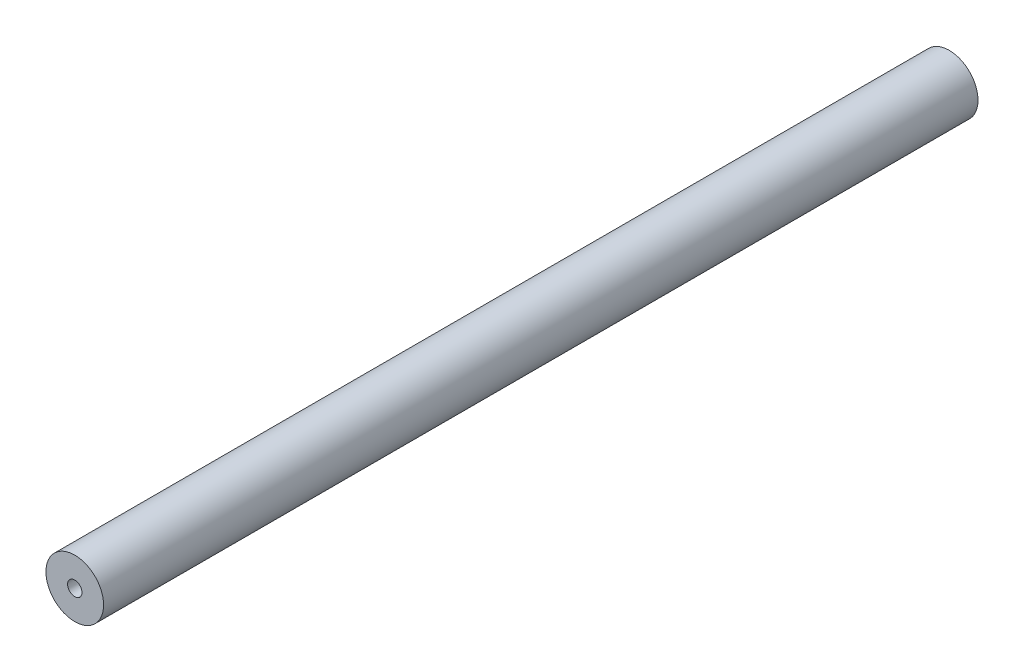
ISO-10303-21;
HEADER;
FILE_DESCRIPTION(('STEP AP214'),'2;1');
FILE_NAME('part.step','',(''),(''),'','','');
FILE_SCHEMA(('AUTOMOTIVE_DESIGN { 1 0 10303 214 1 1 1 1 }'));
ENDSEC;
DATA;
#1=APPLICATION_CONTEXT('core data for automotive mechanical design processes');
#2=APPLICATION_PROTOCOL_DEFINITION('international standard','automotive_design',2000,#1);
#3=PRODUCT_CONTEXT('',#1,'mechanical');
#4=PRODUCT('Part','Part','',(#3));
#5=PRODUCT_RELATED_PRODUCT_CATEGORY('part','',(#4));
#6=PRODUCT_DEFINITION_FORMATION('','',#4);
#7=PRODUCT_DEFINITION_CONTEXT('part definition',#1,'design');
#8=PRODUCT_DEFINITION('design','',#6,#7);
#9=PRODUCT_DEFINITION_SHAPE('','',#8);
#10=(LENGTH_UNIT() NAMED_UNIT(*) SI_UNIT(.MILLI.,.METRE.));
#11=(NAMED_UNIT(*) PLANE_ANGLE_UNIT() SI_UNIT($,.RADIAN.));
#12=(NAMED_UNIT(*) SI_UNIT($,.STERADIAN.) SOLID_ANGLE_UNIT());
#13=UNCERTAINTY_MEASURE_WITH_UNIT(LENGTH_MEASURE(1.E-05),#10,'distance_accuracy_value','');
#14=(GEOMETRIC_REPRESENTATION_CONTEXT(3) GLOBAL_UNCERTAINTY_ASSIGNED_CONTEXT((#13)) GLOBAL_UNIT_ASSIGNED_CONTEXT((#10,
#11,#12)) REPRESENTATION_CONTEXT('',''));
#15=CARTESIAN_POINT('',(0.,0.,0.));
#16=DIRECTION('',(0.,0.,1.));
#17=DIRECTION('',(1.,0.,0.));
#18=AXIS2_PLACEMENT_3D('',#15,#16,#17);
#19=CARTESIAN_POINT('',(0.,0.,182.));
#20=DIRECTION('',(0.,0.,-1.));
#21=DIRECTION('',(-1.,0.,0.));
#22=AXIS2_PLACEMENT_3D('',#19,#20,#21);
#23=CYLINDRICAL_SURFACE('',#22,6.);
#24=CARTESIAN_POINT('',(0.,0.,182.));
#25=DIRECTION('',(0.,0.,1.));
#26=DIRECTION('',(1.,0.,0.));
#27=AXIS2_PLACEMENT_3D('',#24,#25,#26);
#28=CIRCLE('',#27,6.);
#29=CARTESIAN_POINT('',(6.,0.,182.));
#30=VERTEX_POINT('',#29);
#31=EDGE_CURVE('E10',#30,#30,#28,.T.);
#32=ORIENTED_EDGE('',*,*,#31,.F.);
#33=EDGE_LOOP('',(#32));
#34=FACE_BOUND('',#33,.T.);
#35=CARTESIAN_POINT('',(0.,0.,0.));
#36=DIRECTION('',(0.,0.,1.));
#37=DIRECTION('',(1.,0.,0.));
#38=AXIS2_PLACEMENT_3D('',#35,#36,#37);
#39=CIRCLE('',#38,6.);
#40=CARTESIAN_POINT('',(6.,0.,0.));
#41=VERTEX_POINT('',#40);
#42=EDGE_CURVE('E36',#41,#41,#39,.T.);
#43=ORIENTED_EDGE('',*,*,#42,.T.);
#44=EDGE_LOOP('',(#43));
#45=FACE_BOUND('',#44,.T.);
#46=ADVANCED_FACE('F33',(#34,#45),#23,.T.);
#47=CARTESIAN_POINT('',(0.,0.,182.));
#48=DIRECTION('',(0.,0.,1.));
#49=DIRECTION('',(1.,0.,0.));
#50=AXIS2_PLACEMENT_3D('',#47,#48,#49);
#51=PLANE('',#50);
#52=CARTESIAN_POINT('',(0.,0.,182.));
#53=DIRECTION('',(0.,0.,1.));
#54=DIRECTION('',(1.,0.,0.));
#55=AXIS2_PLACEMENT_3D('',#52,#53,#54);
#56=CIRCLE('',#55,1.5);
#57=CARTESIAN_POINT('',(1.5,0.,182.));
#58=VERTEX_POINT('',#57);
#59=EDGE_CURVE('E45',#58,#58,#56,.T.);
#60=ORIENTED_EDGE('',*,*,#59,.F.);
#61=EDGE_LOOP('',(#60));
#62=FACE_BOUND('',#61,.T.);
#63=ORIENTED_EDGE('',*,*,#31,.T.);
#64=EDGE_LOOP('',(#63));
#65=FACE_BOUND('',#64,.T.);
#66=ADVANCED_FACE('F70',(#62,#65),#51,.T.);
#67=CARTESIAN_POINT('',(0.,0.,0.));
#68=DIRECTION('',(0.,0.,1.));
#69=DIRECTION('',(1.,0.,0.));
#70=AXIS2_PLACEMENT_3D('',#67,#68,#69);
#71=PLANE('',#70);
#72=CARTESIAN_POINT('',(0.,0.,0.));
#73=DIRECTION('',(0.,0.,-1.));
#74=DIRECTION('',(-1.,0.,0.));
#75=AXIS2_PLACEMENT_3D('',#72,#73,#74);
#76=CIRCLE('',#75,1.5);
#77=CARTESIAN_POINT('',(-1.5,0.,0.));
#78=VERTEX_POINT('',#77);
#79=EDGE_CURVE('E51',#78,#78,#76,.T.);
#80=ORIENTED_EDGE('',*,*,#79,.F.);
#81=EDGE_LOOP('',(#80));
#82=FACE_BOUND('',#81,.T.);
#83=ORIENTED_EDGE('',*,*,#42,.F.);
#84=EDGE_LOOP('',(#83));
#85=FACE_BOUND('',#84,.T.);
#86=ADVANCED_FACE('F66',(#82,#85),#71,.F.);
#87=CARTESIAN_POINT('',(0.,0.,173.2));
#88=DIRECTION('',(0.,0.,1.));
#89=DIRECTION('',(1.,0.,0.));
#90=AXIS2_PLACEMENT_3D('',#87,#88,#89);
#91=CYLINDRICAL_SURFACE('',#90,1.5);
#92=CARTESIAN_POINT('',(0.,0.,173.2));
#93=DIRECTION('',(0.,0.,1.));
#94=DIRECTION('',(1.,0.,0.));
#95=AXIS2_PLACEMENT_3D('',#92,#93,#94);
#96=CIRCLE('',#95,1.5);
#97=CARTESIAN_POINT('',(1.5,0.,173.2));
#98=VERTEX_POINT('',#97);
#99=EDGE_CURVE('E43',#98,#98,#96,.T.);
#100=ORIENTED_EDGE('',*,*,#99,.F.);
#101=EDGE_LOOP('',(#100));
#102=FACE_BOUND('',#101,.T.);
#103=ORIENTED_EDGE('',*,*,#59,.T.);
#104=EDGE_LOOP('',(#103));
#105=FACE_BOUND('',#104,.T.);
#106=ADVANCED_FACE('F69',(#102,#105),#91,.F.);
#107=CARTESIAN_POINT('',(0.,0.,173.2));
#108=DIRECTION('',(0.,0.,1.));
#109=DIRECTION('',(1.,0.,0.));
#110=AXIS2_PLACEMENT_3D('',#107,#108,#109);
#111=PLANE('',#110);
#112=ORIENTED_EDGE('',*,*,#99,.T.);
#113=EDGE_LOOP('',(#112));
#114=FACE_BOUND('',#113,.T.);
#115=ADVANCED_FACE('F62',(#114),#111,.T.);
#116=CARTESIAN_POINT('',(0.,0.,8.8));
#117=DIRECTION('',(0.,0.,-1.));
#118=DIRECTION('',(-1.,0.,0.));
#119=AXIS2_PLACEMENT_3D('',#116,#117,#118);
#120=CYLINDRICAL_SURFACE('',#119,1.5);
#121=CARTESIAN_POINT('',(0.,0.,8.8));
#122=DIRECTION('',(0.,0.,-1.));
#123=DIRECTION('',(-1.,0.,0.));
#124=AXIS2_PLACEMENT_3D('',#121,#122,#123);
#125=CIRCLE('',#124,1.5);
#126=CARTESIAN_POINT('',(-1.5,0.,8.8));
#127=VERTEX_POINT('',#126);
#128=EDGE_CURVE('E48',#127,#127,#125,.T.);
#129=ORIENTED_EDGE('',*,*,#128,.F.);
#130=EDGE_LOOP('',(#129));
#131=FACE_BOUND('',#130,.T.);
#132=ORIENTED_EDGE('',*,*,#79,.T.);
#133=EDGE_LOOP('',(#132));
#134=FACE_BOUND('',#133,.T.);
#135=ADVANCED_FACE('F59',(#131,#134),#120,.F.);
#136=CARTESIAN_POINT('',(0.,0.,8.8));
#137=DIRECTION('',(0.,0.,-1.));
#138=DIRECTION('',(-1.,0.,0.));
#139=AXIS2_PLACEMENT_3D('',#136,#137,#138);
#140=PLANE('',#139);
#141=ORIENTED_EDGE('',*,*,#128,.T.);
#142=EDGE_LOOP('',(#141));
#143=FACE_BOUND('',#142,.T.);
#144=ADVANCED_FACE('F57',(#143),#140,.T.);
#145=CLOSED_SHELL('',(#46,#66,#86,#106,#115,#135,#144));
#146=MANIFOLD_SOLID_BREP('B2',#145);
#147=ADVANCED_BREP_SHAPE_REPRESENTATION('',(#18,#146),#14);
#148=SHAPE_DEFINITION_REPRESENTATION(#9,#147);
ENDSEC;
END-ISO-10303-21;
